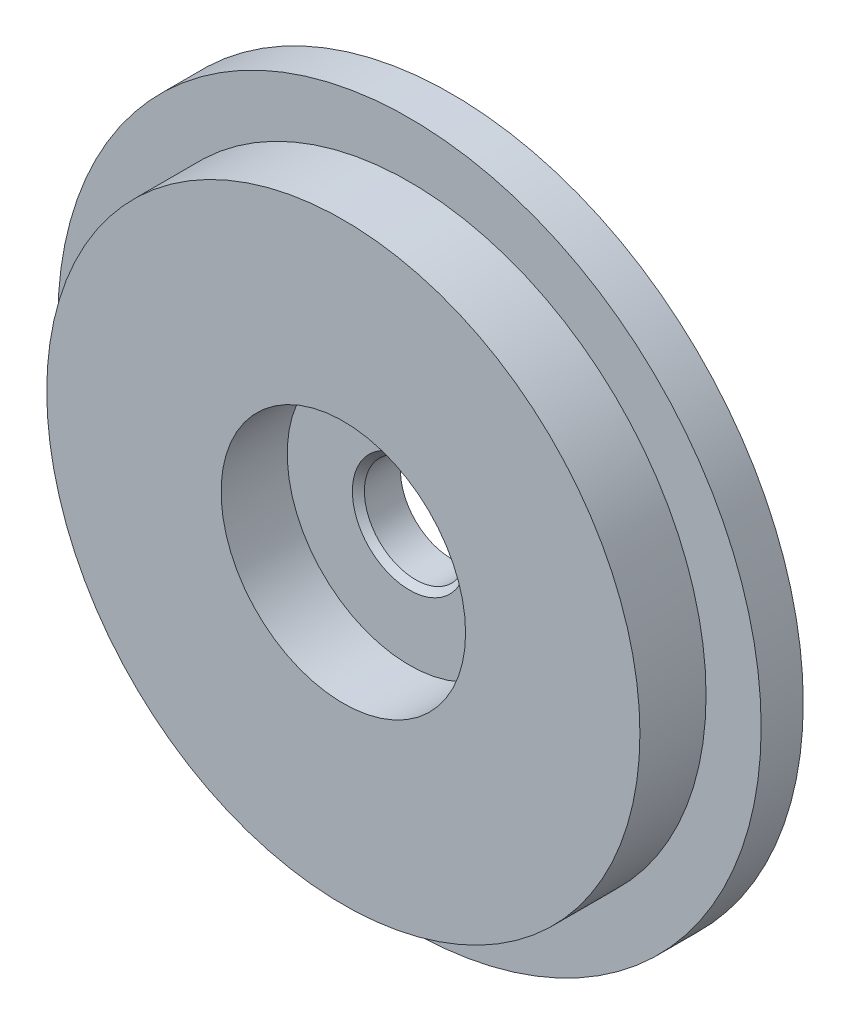
ISO-10303-21;
HEADER;
FILE_DESCRIPTION(('STEP AP214'),'2;1');
FILE_NAME('part.step','',(''),(''),'','','');
FILE_SCHEMA(('AUTOMOTIVE_DESIGN { 1 0 10303 214 1 1 1 1 }'));
ENDSEC;
DATA;
#1=APPLICATION_CONTEXT('core data for automotive mechanical design processes');
#2=APPLICATION_PROTOCOL_DEFINITION('international standard','automotive_design',2000,#1);
#3=PRODUCT_CONTEXT('',#1,'mechanical');
#4=PRODUCT('Part','Part','',(#3));
#5=PRODUCT_RELATED_PRODUCT_CATEGORY('part','',(#4));
#6=PRODUCT_DEFINITION_FORMATION('','',#4);
#7=PRODUCT_DEFINITION_CONTEXT('part definition',#1,'design');
#8=PRODUCT_DEFINITION('design','',#6,#7);
#9=PRODUCT_DEFINITION_SHAPE('','',#8);
#10=(LENGTH_UNIT() NAMED_UNIT(*) SI_UNIT(.MILLI.,.METRE.));
#11=(NAMED_UNIT(*) PLANE_ANGLE_UNIT() SI_UNIT($,.RADIAN.));
#12=(NAMED_UNIT(*) SI_UNIT($,.STERADIAN.) SOLID_ANGLE_UNIT());
#13=UNCERTAINTY_MEASURE_WITH_UNIT(LENGTH_MEASURE(1.E-05),#10,'distance_accuracy_value','');
#14=(GEOMETRIC_REPRESENTATION_CONTEXT(3) GLOBAL_UNCERTAINTY_ASSIGNED_CONTEXT((#13)) GLOBAL_UNIT_ASSIGNED_CONTEXT((#10,
#11,#12)) REPRESENTATION_CONTEXT('',''));
#15=CARTESIAN_POINT('',(0.,0.,0.));
#16=DIRECTION('',(0.,0.,1.));
#17=DIRECTION('',(1.,0.,0.));
#18=AXIS2_PLACEMENT_3D('',#15,#16,#17);
#19=CARTESIAN_POINT('',(0.,0.,2.1));
#20=DIRECTION('',(0.,0.,-1.));
#21=DIRECTION('',(-1.,0.,0.));
#22=AXIS2_PLACEMENT_3D('',#19,#20,#21);
#23=CYLINDRICAL_SURFACE('',#22,17.55);
#24=CARTESIAN_POINT('',(0.,0.,2.1));
#25=DIRECTION('',(0.,0.,1.));
#26=DIRECTION('',(1.,0.,0.));
#27=AXIS2_PLACEMENT_3D('',#24,#25,#26);
#28=CIRCLE('',#27,17.55);
#29=CARTESIAN_POINT('',(17.55,0.,2.1));
#30=VERTEX_POINT('',#29);
#31=EDGE_CURVE('E65',#30,#30,#28,.T.);
#32=ORIENTED_EDGE('',*,*,#31,.F.);
#33=EDGE_LOOP('',(#32));
#34=FACE_BOUND('',#33,.T.);
#35=CARTESIAN_POINT('',(0.,0.,0.));
#36=DIRECTION('',(0.,0.,1.));
#37=DIRECTION('',(1.,0.,0.));
#38=AXIS2_PLACEMENT_3D('',#35,#36,#37);
#39=CIRCLE('',#38,17.55);
#40=CARTESIAN_POINT('',(17.55,0.,0.));
#41=VERTEX_POINT('',#40);
#42=EDGE_CURVE('E68',#41,#41,#39,.T.);
#43=ORIENTED_EDGE('',*,*,#42,.T.);
#44=EDGE_LOOP('',(#43));
#45=FACE_BOUND('',#44,.T.);
#46=ADVANCED_FACE('F43',(#34,#45),#23,.T.);
#47=CARTESIAN_POINT('',(0.,0.,2.1));
#48=DIRECTION('',(0.,0.,1.));
#49=DIRECTION('',(1.,0.,0.));
#50=AXIS2_PLACEMENT_3D('',#47,#48,#49);
#51=PLANE('',#50);
#52=CARTESIAN_POINT('',(0.,0.,2.1));
#53=DIRECTION('',(0.,0.,1.));
#54=DIRECTION('',(1.,0.,0.));
#55=AXIS2_PLACEMENT_3D('',#52,#53,#54);
#56=CIRCLE('',#55,14.8);
#57=CARTESIAN_POINT('',(14.8,0.,2.1));
#58=VERTEX_POINT('',#57);
#59=EDGE_CURVE('E76',#58,#58,#56,.T.);
#60=ORIENTED_EDGE('',*,*,#59,.F.);
#61=EDGE_LOOP('',(#60));
#62=FACE_BOUND('',#61,.T.);
#63=ORIENTED_EDGE('',*,*,#31,.T.);
#64=EDGE_LOOP('',(#63));
#65=FACE_BOUND('',#64,.T.);
#66=ADVANCED_FACE('F106',(#62,#65),#51,.T.);
#67=CARTESIAN_POINT('',(0.,0.,0.));
#68=DIRECTION('',(0.,0.,1.));
#69=DIRECTION('',(1.,0.,0.));
#70=AXIS2_PLACEMENT_3D('',#67,#68,#69);
#71=PLANE('',#70);
#72=CARTESIAN_POINT('',(0.,0.,0.));
#73=DIRECTION('',(0.,0.,1.));
#74=DIRECTION('',(1.,0.,0.));
#75=AXIS2_PLACEMENT_3D('',#72,#73,#74);
#76=CIRCLE('',#75,2.55);
#77=CARTESIAN_POINT('',(2.55,0.,0.));
#78=VERTEX_POINT('',#77);
#79=EDGE_CURVE('E86',#78,#78,#76,.T.);
#80=ORIENTED_EDGE('',*,*,#79,.T.);
#81=EDGE_LOOP('',(#80));
#82=FACE_BOUND('',#81,.T.);
#83=ORIENTED_EDGE('',*,*,#42,.F.);
#84=EDGE_LOOP('',(#83));
#85=FACE_BOUND('',#84,.T.);
#86=ADVANCED_FACE('F92',(#82,#85),#71,.F.);
#87=CARTESIAN_POINT('',(0.,0.,5.4));
#88=DIRECTION('',(0.,0.,1.));
#89=DIRECTION('',(1.,0.,0.));
#90=AXIS2_PLACEMENT_3D('',#87,#88,#89);
#91=PLANE('',#90);
#92=CARTESIAN_POINT('',(0.,0.,5.4));
#93=DIRECTION('',(0.,0.,1.));
#94=DIRECTION('',(1.,0.,0.));
#95=AXIS2_PLACEMENT_3D('',#92,#93,#94);
#96=CIRCLE('',#95,14.8);
#97=CARTESIAN_POINT('',(14.8,0.,5.4));
#98=VERTEX_POINT('',#97);
#99=EDGE_CURVE('E72',#98,#98,#96,.T.);
#100=ORIENTED_EDGE('',*,*,#99,.T.);
#101=EDGE_LOOP('',(#100));
#102=FACE_BOUND('',#101,.T.);
#103=CARTESIAN_POINT('',(0.,0.,5.4));
#104=DIRECTION('',(0.,0.,1.));
#105=DIRECTION('',(1.,0.,0.));
#106=AXIS2_PLACEMENT_3D('',#103,#104,#105);
#107=CIRCLE('',#106,6.1);
#108=CARTESIAN_POINT('',(6.1,0.,5.4));
#109=VERTEX_POINT('',#108);
#110=EDGE_CURVE('E80',#109,#109,#107,.T.);
#111=ORIENTED_EDGE('',*,*,#110,.F.);
#112=EDGE_LOOP('',(#111));
#113=FACE_BOUND('',#112,.T.);
#114=ADVANCED_FACE('F118',(#102,#113),#91,.T.);
#115=CARTESIAN_POINT('',(0.,0.,5.4));
#116=DIRECTION('',(0.,0.,-1.));
#117=DIRECTION('',(-1.,0.,0.));
#118=AXIS2_PLACEMENT_3D('',#115,#116,#117);
#119=CYLINDRICAL_SURFACE('',#118,14.8);
#120=ORIENTED_EDGE('',*,*,#99,.F.);
#121=EDGE_LOOP('',(#120));
#122=FACE_BOUND('',#121,.T.);
#123=ORIENTED_EDGE('',*,*,#59,.T.);
#124=EDGE_LOOP('',(#123));
#125=FACE_BOUND('',#124,.T.);
#126=ADVANCED_FACE('F120',(#122,#125),#119,.T.);
#127=CARTESIAN_POINT('',(0.,0.,5.4));
#128=DIRECTION('',(0.,0.,-1.));
#129=DIRECTION('',(-1.,0.,0.));
#130=AXIS2_PLACEMENT_3D('',#127,#128,#129);
#131=CYLINDRICAL_SURFACE('',#130,6.1);
#132=ORIENTED_EDGE('',*,*,#110,.T.);
#133=EDGE_LOOP('',(#132));
#134=FACE_BOUND('',#133,.T.);
#135=CARTESIAN_POINT('',(0.,0.,2.1));
#136=DIRECTION('',(0.,0.,1.));
#137=DIRECTION('',(1.,0.,0.));
#138=AXIS2_PLACEMENT_3D('',#135,#136,#137);
#139=CIRCLE('',#138,6.1);
#140=CARTESIAN_POINT('',(6.1,0.,2.1));
#141=VERTEX_POINT('',#140);
#142=EDGE_CURVE('E59',#141,#141,#139,.F.);
#143=ORIENTED_EDGE('',*,*,#142,.T.);
#144=EDGE_LOOP('',(#143));
#145=FACE_BOUND('',#144,.T.);
#146=ADVANCED_FACE('F104',(#134,#145),#131,.F.);
#147=CARTESIAN_POINT('',(0.,0.,2.1));
#148=DIRECTION('',(0.,0.,1.));
#149=DIRECTION('',(1.,0.,0.));
#150=AXIS2_PLACEMENT_3D('',#147,#148,#149);
#151=CIRCLE('',#150,2.84999999999999);
#152=CARTESIAN_POINT('',(2.84999999999999,0.,2.1));
#153=VERTEX_POINT('',#152);
#154=EDGE_CURVE('E10',#153,#153,#151,.F.);
#155=ORIENTED_EDGE('',*,*,#154,.T.);
#156=EDGE_LOOP('',(#155));
#157=FACE_BOUND('',#156,.T.);
#158=ORIENTED_EDGE('',*,*,#142,.F.);
#159=EDGE_LOOP('',(#158));
#160=FACE_BOUND('',#159,.T.);
#161=ADVANCED_FACE('F97',(#157,#160),#51,.T.);
#162=CARTESIAN_POINT('',(0.,0.,5.401));
#163=DIRECTION('',(0.,0.,-1.));
#164=DIRECTION('',(-1.,0.,0.));
#165=AXIS2_PLACEMENT_3D('',#162,#163,#164);
#166=CYLINDRICAL_SURFACE('',#165,2.55);
#167=CARTESIAN_POINT('',(0.,0.,1.80000000000002));
#168=DIRECTION('',(0.,0.,1.));
#169=DIRECTION('',(1.,0.,0.));
#170=AXIS2_PLACEMENT_3D('',#167,#168,#169);
#171=CIRCLE('',#170,2.55);
#172=CARTESIAN_POINT('',(2.55,0.,1.80000000000002));
#173=VERTEX_POINT('',#172);
#174=EDGE_CURVE('E52',#173,#173,#171,.T.);
#175=ORIENTED_EDGE('',*,*,#174,.T.);
#176=EDGE_LOOP('',(#175));
#177=FACE_BOUND('',#176,.T.);
#178=ORIENTED_EDGE('',*,*,#79,.F.);
#179=EDGE_LOOP('',(#178));
#180=FACE_BOUND('',#179,.T.);
#181=ADVANCED_FACE('F95',(#177,#180),#166,.F.);
#182=CARTESIAN_POINT('',(0.,0.,1.80000000000002));
#183=DIRECTION('',(0.,0.,1.));
#184=DIRECTION('',(1.,0.,0.));
#185=AXIS2_PLACEMENT_3D('',#182,#183,#184);
#186=CONICAL_SURFACE('',#185,2.55,0.785398163397462);
#187=ORIENTED_EDGE('',*,*,#154,.F.);
#188=EDGE_LOOP('',(#187));
#189=FACE_BOUND('',#188,.T.);
#190=ORIENTED_EDGE('',*,*,#174,.F.);
#191=EDGE_LOOP('',(#190));
#192=FACE_BOUND('',#191,.T.);
#193=ADVANCED_FACE('F46',(#189,#192),#186,.F.);
#194=CLOSED_SHELL('',(#46,#66,#86,#114,#126,#146,#161,#181,#193));
#195=MANIFOLD_SOLID_BREP('B2',#194);
#196=ADVANCED_BREP_SHAPE_REPRESENTATION('',(#18,#195),#14);
#197=SHAPE_DEFINITION_REPRESENTATION(#9,#196);
ENDSEC;
END-ISO-10303-21;
